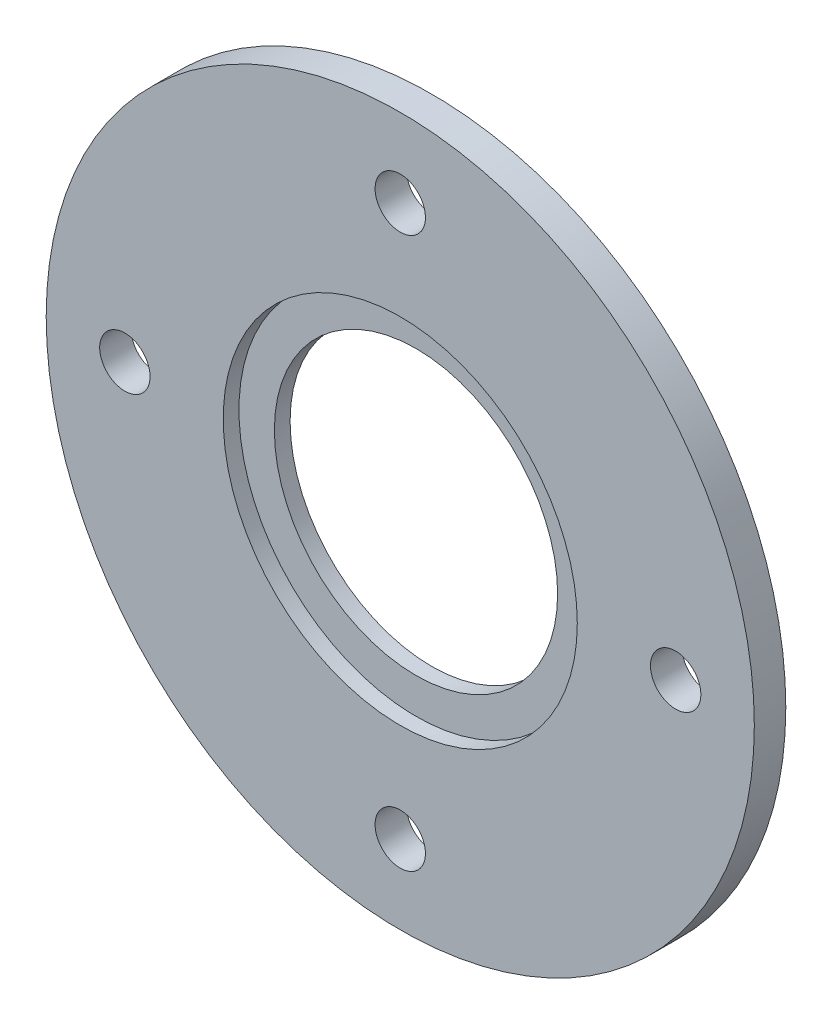
ISO-10303-21;
HEADER;
FILE_DESCRIPTION(('STEP AP214'),'2;1');
FILE_NAME('part.step','',(''),(''),'','','');
FILE_SCHEMA(('AUTOMOTIVE_DESIGN { 1 0 10303 214 1 1 1 1 }'));
ENDSEC;
DATA;
#1=APPLICATION_CONTEXT('core data for automotive mechanical design processes');
#2=APPLICATION_PROTOCOL_DEFINITION('international standard','automotive_design',2000,#1);
#3=PRODUCT_CONTEXT('',#1,'mechanical');
#4=PRODUCT('Part','Part','',(#3));
#5=PRODUCT_RELATED_PRODUCT_CATEGORY('part','',(#4));
#6=PRODUCT_DEFINITION_FORMATION('','',#4);
#7=PRODUCT_DEFINITION_CONTEXT('part definition',#1,'design');
#8=PRODUCT_DEFINITION('design','',#6,#7);
#9=PRODUCT_DEFINITION_SHAPE('','',#8);
#10=(LENGTH_UNIT() NAMED_UNIT(*) SI_UNIT(.MILLI.,.METRE.));
#11=(NAMED_UNIT(*) PLANE_ANGLE_UNIT() SI_UNIT($,.RADIAN.));
#12=(NAMED_UNIT(*) SI_UNIT($,.STERADIAN.) SOLID_ANGLE_UNIT());
#13=UNCERTAINTY_MEASURE_WITH_UNIT(LENGTH_MEASURE(1.E-05),#10,'distance_accuracy_value','');
#14=(GEOMETRIC_REPRESENTATION_CONTEXT(3) GLOBAL_UNCERTAINTY_ASSIGNED_CONTEXT((#13)) GLOBAL_UNIT_ASSIGNED_CONTEXT((#10,
#11,#12)) REPRESENTATION_CONTEXT('',''));
#15=CARTESIAN_POINT('',(0.,0.,0.));
#16=DIRECTION('',(0.,0.,1.));
#17=DIRECTION('',(1.,0.,0.));
#18=AXIS2_PLACEMENT_3D('',#15,#16,#17);
#19=CARTESIAN_POINT('',(0.,0.,2.));
#20=DIRECTION('',(0.,0.,-1.));
#21=DIRECTION('',(-1.,0.,0.));
#22=AXIS2_PLACEMENT_3D('',#19,#20,#21);
#23=CYLINDRICAL_SURFACE('',#22,9.);
#24=CARTESIAN_POINT('',(0.,0.,0.));
#25=DIRECTION('',(0.,0.,1.));
#26=DIRECTION('',(1.,0.,0.));
#27=AXIS2_PLACEMENT_3D('',#24,#25,#26);
#28=CIRCLE('',#27,9.);
#29=CARTESIAN_POINT('',(9.,0.,0.));
#30=VERTEX_POINT('',#29);
#31=EDGE_CURVE('E50',#30,#30,#28,.T.);
#32=ORIENTED_EDGE('',*,*,#31,.F.);
#33=EDGE_LOOP('',(#32));
#34=FACE_BOUND('',#33,.T.);
#35=CARTESIAN_POINT('',(0.,0.,1.));
#36=DIRECTION('',(0.,0.,1.));
#37=DIRECTION('',(1.,0.,0.));
#38=AXIS2_PLACEMENT_3D('',#35,#36,#37);
#39=CIRCLE('',#38,9.);
#40=CARTESIAN_POINT('',(9.,0.,1.));
#41=VERTEX_POINT('',#40);
#42=EDGE_CURVE('E82',#41,#41,#39,.T.);
#43=ORIENTED_EDGE('',*,*,#42,.T.);
#44=EDGE_LOOP('',(#43));
#45=FACE_BOUND('',#44,.T.);
#46=ADVANCED_FACE('F39',(#34,#45),#23,.F.);
#47=CARTESIAN_POINT('',(0.,0.,2.));
#48=DIRECTION('',(0.,0.,1.));
#49=DIRECTION('',(1.,0.,0.));
#50=AXIS2_PLACEMENT_3D('',#47,#48,#49);
#51=PLANE('',#50);
#52=CARTESIAN_POINT('',(0.,0.,2.));
#53=DIRECTION('',(0.,0.,1.));
#54=DIRECTION('',(1.,0.,0.));
#55=AXIS2_PLACEMENT_3D('',#52,#53,#54);
#56=CIRCLE('',#55,11.25);
#57=CARTESIAN_POINT('',(11.25,0.,2.));
#58=VERTEX_POINT('',#57);
#59=EDGE_CURVE('E79',#58,#58,#56,.T.);
#60=ORIENTED_EDGE('',*,*,#59,.F.);
#61=EDGE_LOOP('',(#60));
#62=FACE_BOUND('',#61,.T.);
#63=CARTESIAN_POINT('',(0.,17.5,2.));
#64=DIRECTION('',(0.,0.,1.));
#65=DIRECTION('',(0.,-1.,0.));
#66=AXIS2_PLACEMENT_3D('',#63,#64,#65);
#67=CIRCLE('',#66,1.6);
#68=CARTESIAN_POINT('',(0.,15.9,2.));
#69=VERTEX_POINT('',#68);
#70=EDGE_CURVE('E74',#69,#69,#67,.T.);
#71=ORIENTED_EDGE('',*,*,#70,.F.);
#72=EDGE_LOOP('',(#71));
#73=FACE_BOUND('',#72,.T.);
#74=CARTESIAN_POINT('',(17.5,0.,2.));
#75=DIRECTION('',(0.,0.,1.));
#76=DIRECTION('',(-1.,0.,0.));
#77=AXIS2_PLACEMENT_3D('',#74,#75,#76);
#78=CIRCLE('',#77,1.6);
#79=CARTESIAN_POINT('',(15.9,0.,2.));
#80=VERTEX_POINT('',#79);
#81=EDGE_CURVE('E68',#80,#80,#78,.T.);
#82=ORIENTED_EDGE('',*,*,#81,.F.);
#83=EDGE_LOOP('',(#82));
#84=FACE_BOUND('',#83,.T.);
#85=CARTESIAN_POINT('',(-1.83302770289265E-13,-17.5,2.));
#86=DIRECTION('',(0.,0.,1.));
#87=DIRECTION('',(0.,1.,0.));
#88=AXIS2_PLACEMENT_3D('',#85,#86,#87);
#89=CIRCLE('',#88,1.6);
#90=CARTESIAN_POINT('',(-1.66543659862817E-13,-15.9,2.));
#91=VERTEX_POINT('',#90);
#92=EDGE_CURVE('E61',#91,#91,#89,.T.);
#93=ORIENTED_EDGE('',*,*,#92,.F.);
#94=EDGE_LOOP('',(#93));
#95=FACE_BOUND('',#94,.T.);
#96=CARTESIAN_POINT('',(-17.5,0.,2.));
#97=DIRECTION('',(0.,0.,1.));
#98=DIRECTION('',(1.,0.,0.));
#99=AXIS2_PLACEMENT_3D('',#96,#97,#98);
#100=CIRCLE('',#99,1.6);
#101=CARTESIAN_POINT('',(-15.9,0.,2.));
#102=VERTEX_POINT('',#101);
#103=EDGE_CURVE('E55',#102,#102,#100,.T.);
#104=ORIENTED_EDGE('',*,*,#103,.F.);
#105=EDGE_LOOP('',(#104));
#106=FACE_BOUND('',#105,.T.);
#107=CARTESIAN_POINT('',(0.,0.,2.));
#108=DIRECTION('',(0.,0.,1.));
#109=DIRECTION('',(1.,0.,0.));
#110=AXIS2_PLACEMENT_3D('',#107,#108,#109);
#111=CIRCLE('',#110,22.5);
#112=CARTESIAN_POINT('',(22.5,0.,2.));
#113=VERTEX_POINT('',#112);
#114=EDGE_CURVE('E10',#113,#113,#111,.T.);
#115=ORIENTED_EDGE('',*,*,#114,.T.);
#116=EDGE_LOOP('',(#115));
#117=FACE_BOUND('',#116,.T.);
#118=ADVANCED_FACE('F102',(#62,#73,#84,#95,#106,#117),#51,.T.);
#119=CARTESIAN_POINT('',(0.,0.,0.));
#120=DIRECTION('',(0.,0.,1.));
#121=DIRECTION('',(1.,0.,0.));
#122=AXIS2_PLACEMENT_3D('',#119,#120,#121);
#123=PLANE('',#122);
#124=CARTESIAN_POINT('',(0.,17.5,0.));
#125=DIRECTION('',(0.,0.,1.));
#126=DIRECTION('',(0.,-1.,0.));
#127=AXIS2_PLACEMENT_3D('',#124,#125,#126);
#128=CIRCLE('',#127,1.6);
#129=CARTESIAN_POINT('',(0.,15.9,0.));
#130=VERTEX_POINT('',#129);
#131=EDGE_CURVE('E58',#130,#130,#128,.T.);
#132=ORIENTED_EDGE('',*,*,#131,.T.);
#133=EDGE_LOOP('',(#132));
#134=FACE_BOUND('',#133,.T.);
#135=CARTESIAN_POINT('',(17.5,0.,0.));
#136=DIRECTION('',(0.,0.,1.));
#137=DIRECTION('',(-1.,0.,0.));
#138=AXIS2_PLACEMENT_3D('',#135,#136,#137);
#139=CIRCLE('',#138,1.6);
#140=CARTESIAN_POINT('',(15.9,0.,0.));
#141=VERTEX_POINT('',#140);
#142=EDGE_CURVE('E71',#141,#141,#139,.T.);
#143=ORIENTED_EDGE('',*,*,#142,.T.);
#144=EDGE_LOOP('',(#143));
#145=FACE_BOUND('',#144,.T.);
#146=CARTESIAN_POINT('',(-1.83302770289265E-13,-17.5,0.));
#147=DIRECTION('',(0.,0.,1.));
#148=DIRECTION('',(0.,1.,0.));
#149=AXIS2_PLACEMENT_3D('',#146,#147,#148);
#150=CIRCLE('',#149,1.6);
#151=CARTESIAN_POINT('',(-1.66543659862817E-13,-15.9,0.));
#152=VERTEX_POINT('',#151);
#153=EDGE_CURVE('E64',#152,#152,#150,.T.);
#154=ORIENTED_EDGE('',*,*,#153,.T.);
#155=EDGE_LOOP('',(#154));
#156=FACE_BOUND('',#155,.T.);
#157=CARTESIAN_POINT('',(-17.5,0.,0.));
#158=DIRECTION('',(0.,0.,1.));
#159=DIRECTION('',(1.,0.,0.));
#160=AXIS2_PLACEMENT_3D('',#157,#158,#159);
#161=CIRCLE('',#160,1.6);
#162=CARTESIAN_POINT('',(-15.9,0.,0.));
#163=VERTEX_POINT('',#162);
#164=EDGE_CURVE('E54',#163,#163,#161,.T.);
#165=ORIENTED_EDGE('',*,*,#164,.T.);
#166=EDGE_LOOP('',(#165));
#167=FACE_BOUND('',#166,.T.);
#168=CARTESIAN_POINT('',(0.,0.,0.));
#169=DIRECTION('',(0.,0.,1.));
#170=DIRECTION('',(1.,0.,0.));
#171=AXIS2_PLACEMENT_3D('',#168,#169,#170);
#172=CIRCLE('',#171,22.5);
#173=CARTESIAN_POINT('',(22.5,0.,0.));
#174=VERTEX_POINT('',#173);
#175=EDGE_CURVE('E43',#174,#174,#172,.T.);
#176=ORIENTED_EDGE('',*,*,#175,.F.);
#177=EDGE_LOOP('',(#176));
#178=FACE_BOUND('',#177,.T.);
#179=ORIENTED_EDGE('',*,*,#31,.T.);
#180=EDGE_LOOP('',(#179));
#181=FACE_BOUND('',#180,.T.);
#182=ADVANCED_FACE('F105',(#134,#145,#156,#167,#178,#181),#123,.F.);
#183=CARTESIAN_POINT('',(0.,0.,2.));
#184=DIRECTION('',(0.,0.,-1.));
#185=DIRECTION('',(-1.,0.,0.));
#186=AXIS2_PLACEMENT_3D('',#183,#184,#185);
#187=CYLINDRICAL_SURFACE('',#186,22.5);
#188=ORIENTED_EDGE('',*,*,#114,.F.);
#189=EDGE_LOOP('',(#188));
#190=FACE_BOUND('',#189,.T.);
#191=ORIENTED_EDGE('',*,*,#175,.T.);
#192=EDGE_LOOP('',(#191));
#193=FACE_BOUND('',#192,.T.);
#194=ADVANCED_FACE('F41',(#190,#193),#187,.T.);
#195=CARTESIAN_POINT('',(-17.5,0.,0.));
#196=DIRECTION('',(0.,0.,1.));
#197=DIRECTION('',(1.,0.,0.));
#198=AXIS2_PLACEMENT_3D('',#195,#196,#197);
#199=CYLINDRICAL_SURFACE('',#198,1.6);
#200=ORIENTED_EDGE('',*,*,#164,.F.);
#201=EDGE_LOOP('',(#200));
#202=FACE_BOUND('',#201,.T.);
#203=ORIENTED_EDGE('',*,*,#103,.T.);
#204=EDGE_LOOP('',(#203));
#205=FACE_BOUND('',#204,.T.);
#206=ADVANCED_FACE('F115',(#202,#205),#199,.F.);
#207=CARTESIAN_POINT('',(-1.83302770289265E-13,-17.5,0.));
#208=DIRECTION('',(0.,0.,1.));
#209=DIRECTION('',(1.,0.,0.));
#210=AXIS2_PLACEMENT_3D('',#207,#208,#209);
#211=CYLINDRICAL_SURFACE('',#210,1.6);
#212=ORIENTED_EDGE('',*,*,#153,.F.);
#213=EDGE_LOOP('',(#212));
#214=FACE_BOUND('',#213,.T.);
#215=ORIENTED_EDGE('',*,*,#92,.T.);
#216=EDGE_LOOP('',(#215));
#217=FACE_BOUND('',#216,.T.);
#218=ADVANCED_FACE('F117',(#214,#217),#211,.F.);
#219=CARTESIAN_POINT('',(17.5,0.,0.));
#220=DIRECTION('',(0.,0.,1.));
#221=DIRECTION('',(1.,0.,0.));
#222=AXIS2_PLACEMENT_3D('',#219,#220,#221);
#223=CYLINDRICAL_SURFACE('',#222,1.6);
#224=ORIENTED_EDGE('',*,*,#142,.F.);
#225=EDGE_LOOP('',(#224));
#226=FACE_BOUND('',#225,.T.);
#227=ORIENTED_EDGE('',*,*,#81,.T.);
#228=EDGE_LOOP('',(#227));
#229=FACE_BOUND('',#228,.T.);
#230=ADVANCED_FACE('F125',(#226,#229),#223,.F.);
#231=CARTESIAN_POINT('',(0.,17.5,0.));
#232=DIRECTION('',(0.,0.,1.));
#233=DIRECTION('',(1.,0.,0.));
#234=AXIS2_PLACEMENT_3D('',#231,#232,#233);
#235=CYLINDRICAL_SURFACE('',#234,1.6);
#236=ORIENTED_EDGE('',*,*,#131,.F.);
#237=EDGE_LOOP('',(#236));
#238=FACE_BOUND('',#237,.T.);
#239=ORIENTED_EDGE('',*,*,#70,.T.);
#240=EDGE_LOOP('',(#239));
#241=FACE_BOUND('',#240,.T.);
#242=ADVANCED_FACE('F98',(#238,#241),#235,.F.);
#243=CARTESIAN_POINT('',(0.,0.,1.));
#244=DIRECTION('',(0.,0.,1.));
#245=DIRECTION('',(1.,0.,0.));
#246=AXIS2_PLACEMENT_3D('',#243,#244,#245);
#247=CYLINDRICAL_SURFACE('',#246,11.25);
#248=CARTESIAN_POINT('',(0.,0.,1.));
#249=DIRECTION('',(0.,0.,1.));
#250=DIRECTION('',(1.,0.,0.));
#251=AXIS2_PLACEMENT_3D('',#248,#249,#250);
#252=CIRCLE('',#251,11.25);
#253=CARTESIAN_POINT('',(11.25,0.,1.));
#254=VERTEX_POINT('',#253);
#255=EDGE_CURVE('E65',#254,#254,#252,.T.);
#256=ORIENTED_EDGE('',*,*,#255,.F.);
#257=EDGE_LOOP('',(#256));
#258=FACE_BOUND('',#257,.T.);
#259=ORIENTED_EDGE('',*,*,#59,.T.);
#260=EDGE_LOOP('',(#259));
#261=FACE_BOUND('',#260,.T.);
#262=ADVANCED_FACE('F92',(#258,#261),#247,.F.);
#263=CARTESIAN_POINT('',(0.,0.,1.));
#264=DIRECTION('',(0.,0.,1.));
#265=DIRECTION('',(1.,0.,0.));
#266=AXIS2_PLACEMENT_3D('',#263,#264,#265);
#267=PLANE('',#266);
#268=ORIENTED_EDGE('',*,*,#42,.F.);
#269=EDGE_LOOP('',(#268));
#270=FACE_BOUND('',#269,.T.);
#271=ORIENTED_EDGE('',*,*,#255,.T.);
#272=EDGE_LOOP('',(#271));
#273=FACE_BOUND('',#272,.T.);
#274=ADVANCED_FACE('F89',(#270,#273),#267,.T.);
#275=CLOSED_SHELL('',(#46,#118,#182,#194,#206,#218,#230,#242,#262,#274));
#276=MANIFOLD_SOLID_BREP('B2',#275);
#277=ADVANCED_BREP_SHAPE_REPRESENTATION('',(#18,#276),#14);
#278=SHAPE_DEFINITION_REPRESENTATION(#9,#277);
ENDSEC;
END-ISO-10303-21;
